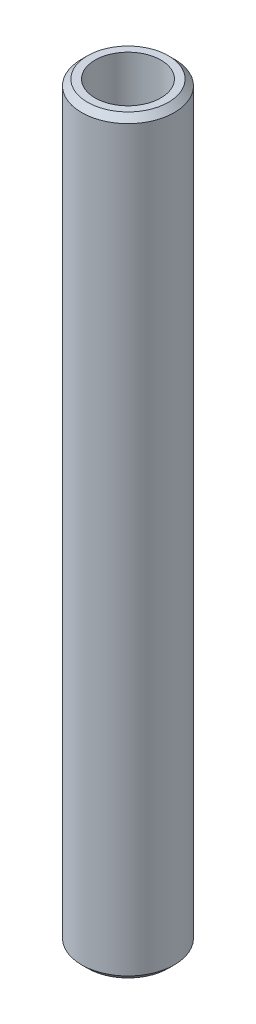
ISO-10303-21;
HEADER;
FILE_DESCRIPTION(('STEP AP214'),'2;1');
FILE_NAME('part.step','',(''),(''),'','','');
FILE_SCHEMA(('AUTOMOTIVE_DESIGN { 1 0 10303 214 1 1 1 1 }'));
ENDSEC;
DATA;
#1=APPLICATION_CONTEXT('core data for automotive mechanical design processes');
#2=APPLICATION_PROTOCOL_DEFINITION('international standard','automotive_design',2000,#1);
#3=PRODUCT_CONTEXT('',#1,'mechanical');
#4=PRODUCT('Part','Part','',(#3));
#5=PRODUCT_RELATED_PRODUCT_CATEGORY('part','',(#4));
#6=PRODUCT_DEFINITION_FORMATION('','',#4);
#7=PRODUCT_DEFINITION_CONTEXT('part definition',#1,'design');
#8=PRODUCT_DEFINITION('design','',#6,#7);
#9=PRODUCT_DEFINITION_SHAPE('','',#8);
#10=(LENGTH_UNIT() NAMED_UNIT(*) SI_UNIT(.MILLI.,.METRE.));
#11=(NAMED_UNIT(*) PLANE_ANGLE_UNIT() SI_UNIT($,.RADIAN.));
#12=(NAMED_UNIT(*) SI_UNIT($,.STERADIAN.) SOLID_ANGLE_UNIT());
#13=UNCERTAINTY_MEASURE_WITH_UNIT(LENGTH_MEASURE(1.E-05),#10,'distance_accuracy_value','');
#14=(GEOMETRIC_REPRESENTATION_CONTEXT(3) GLOBAL_UNCERTAINTY_ASSIGNED_CONTEXT((#13)) GLOBAL_UNIT_ASSIGNED_CONTEXT((#10,
#11,#12)) REPRESENTATION_CONTEXT('',''));
#15=CARTESIAN_POINT('',(0.,0.,0.));
#16=DIRECTION('',(0.,0.,1.));
#17=DIRECTION('',(1.,0.,0.));
#18=AXIS2_PLACEMENT_3D('',#15,#16,#17);
#19=CARTESIAN_POINT('',(0.,323.712810343849,0.));
#20=DIRECTION('',(0.,-1.,0.));
#21=DIRECTION('',(0.,0.,-1.));
#22=AXIS2_PLACEMENT_3D('',#19,#20,#21);
#23=CYLINDRICAL_SURFACE('',#22,20.);
#24=CARTESIAN_POINT('',(0.,321.148744685183,0.));
#25=DIRECTION('',(0.,1.,0.));
#26=DIRECTION('',(0.,0.,1.));
#27=AXIS2_PLACEMENT_3D('',#24,#25,#26);
#28=CIRCLE('',#27,20.);
#29=CARTESIAN_POINT('',(0.,321.148744685183,20.));
#30=VERTEX_POINT('',#29);
#31=EDGE_CURVE('E50',#30,#30,#28,.F.);
#32=ORIENTED_EDGE('',*,*,#31,.T.);
#33=EDGE_LOOP('',(#32));
#34=FACE_BOUND('',#33,.T.);
#35=CARTESIAN_POINT('',(0.,2.56406565866552,0.));
#36=DIRECTION('',(0.,1.,0.));
#37=DIRECTION('',(0.,0.,1.));
#38=AXIS2_PLACEMENT_3D('',#35,#36,#37);
#39=CIRCLE('',#38,20.);
#40=CARTESIAN_POINT('',(0.,2.56406565866552,20.));
#41=VERTEX_POINT('',#40);
#42=EDGE_CURVE('E51',#41,#41,#39,.T.);
#43=ORIENTED_EDGE('',*,*,#42,.T.);
#44=EDGE_LOOP('',(#43));
#45=FACE_BOUND('',#44,.T.);
#46=ADVANCED_FACE('F39',(#34,#45),#23,.T.);
#47=CARTESIAN_POINT('',(0.,323.712810343849,0.));
#48=DIRECTION('',(0.,1.,0.));
#49=DIRECTION('',(0.,0.,1.));
#50=AXIS2_PLACEMENT_3D('',#47,#48,#49);
#51=PLANE('',#50);
#52=CARTESIAN_POINT('',(0.,323.712810343849,0.));
#53=DIRECTION('',(0.,1.,0.));
#54=DIRECTION('',(0.,0.,1.));
#55=AXIS2_PLACEMENT_3D('',#52,#53,#54);
#56=CIRCLE('',#55,17.4359343413345);
#57=CARTESIAN_POINT('',(0.,323.712810343849,17.4359343413345));
#58=VERTEX_POINT('',#57);
#59=EDGE_CURVE('E54',#58,#58,#56,.T.);
#60=ORIENTED_EDGE('',*,*,#59,.T.);
#61=EDGE_LOOP('',(#60));
#62=FACE_BOUND('',#61,.T.);
#63=CARTESIAN_POINT('',(0.,323.712810343849,0.));
#64=DIRECTION('',(0.,1.,0.));
#65=DIRECTION('',(0.,0.,1.));
#66=AXIS2_PLACEMENT_3D('',#63,#64,#65);
#67=CIRCLE('',#66,14.1911505131248);
#68=CARTESIAN_POINT('',(0.,323.712810343849,14.1911505131248));
#69=VERTEX_POINT('',#68);
#70=EDGE_CURVE('E58',#69,#69,#67,.T.);
#71=ORIENTED_EDGE('',*,*,#70,.F.);
#72=EDGE_LOOP('',(#71));
#73=FACE_BOUND('',#72,.T.);
#74=ADVANCED_FACE('F69',(#62,#73),#51,.T.);
#75=CARTESIAN_POINT('',(0.,0.,0.));
#76=DIRECTION('',(0.,1.,0.));
#77=DIRECTION('',(0.,0.,1.));
#78=AXIS2_PLACEMENT_3D('',#75,#76,#77);
#79=PLANE('',#78);
#80=CARTESIAN_POINT('',(0.,0.,0.));
#81=DIRECTION('',(0.,1.,0.));
#82=DIRECTION('',(0.,0.,1.));
#83=AXIS2_PLACEMENT_3D('',#80,#81,#82);
#84=CIRCLE('',#83,17.4359343413345);
#85=CARTESIAN_POINT('',(0.,0.,17.4359343413345));
#86=VERTEX_POINT('',#85);
#87=EDGE_CURVE('E10',#86,#86,#84,.F.);
#88=ORIENTED_EDGE('',*,*,#87,.T.);
#89=EDGE_LOOP('',(#88));
#90=FACE_BOUND('',#89,.T.);
#91=CARTESIAN_POINT('',(0.,0.,0.));
#92=DIRECTION('',(0.,1.,0.));
#93=DIRECTION('',(0.,0.,1.));
#94=AXIS2_PLACEMENT_3D('',#91,#92,#93);
#95=CIRCLE('',#94,14.1911505131248);
#96=CARTESIAN_POINT('',(0.,0.,14.1911505131248));
#97=VERTEX_POINT('',#96);
#98=EDGE_CURVE('E63',#97,#97,#95,.T.);
#99=ORIENTED_EDGE('',*,*,#98,.T.);
#100=EDGE_LOOP('',(#99));
#101=FACE_BOUND('',#100,.T.);
#102=ADVANCED_FACE('F75',(#90,#101),#79,.F.);
#103=CARTESIAN_POINT('',(0.,323.712810343849,0.));
#104=DIRECTION('',(0.,-1.,0.));
#105=DIRECTION('',(0.,0.,-1.));
#106=AXIS2_PLACEMENT_3D('',#103,#104,#105);
#107=CYLINDRICAL_SURFACE('',#106,14.1911505131248);
#108=ORIENTED_EDGE('',*,*,#70,.T.);
#109=EDGE_LOOP('',(#108));
#110=FACE_BOUND('',#109,.T.);
#111=ORIENTED_EDGE('',*,*,#98,.F.);
#112=EDGE_LOOP('',(#111));
#113=FACE_BOUND('',#112,.T.);
#114=ADVANCED_FACE('F70',(#110,#113),#107,.F.);
#115=CARTESIAN_POINT('',(0.,323.712810343849,0.));
#116=DIRECTION('',(0.,-1.,0.));
#117=DIRECTION('',(0.,0.,-1.));
#118=AXIS2_PLACEMENT_3D('',#115,#116,#117);
#119=CONICAL_SURFACE('',#118,17.4359343413345,0.78539816339744);
#120=ORIENTED_EDGE('',*,*,#31,.F.);
#121=EDGE_LOOP('',(#120));
#122=FACE_BOUND('',#121,.T.);
#123=ORIENTED_EDGE('',*,*,#59,.F.);
#124=EDGE_LOOP('',(#123));
#125=FACE_BOUND('',#124,.T.);
#126=ADVANCED_FACE('F81',(#122,#125),#119,.T.);
#127=CARTESIAN_POINT('',(0.,2.56406565866552,0.));
#128=DIRECTION('',(0.,1.,0.));
#129=DIRECTION('',(0.,0.,1.));
#130=AXIS2_PLACEMENT_3D('',#127,#128,#129);
#131=CONICAL_SURFACE('',#130,20.,0.78539816339745);
#132=ORIENTED_EDGE('',*,*,#87,.F.);
#133=EDGE_LOOP('',(#132));
#134=FACE_BOUND('',#133,.T.);
#135=ORIENTED_EDGE('',*,*,#42,.F.);
#136=EDGE_LOOP('',(#135));
#137=FACE_BOUND('',#136,.T.);
#138=ADVANCED_FACE('F45',(#134,#137),#131,.T.);
#139=CLOSED_SHELL('',(#46,#74,#102,#114,#126,#138));
#140=MANIFOLD_SOLID_BREP('B2',#139);
#141=ADVANCED_BREP_SHAPE_REPRESENTATION('',(#18,#140),#14);
#142=SHAPE_DEFINITION_REPRESENTATION(#9,#141);
ENDSEC;
END-ISO-10303-21;
